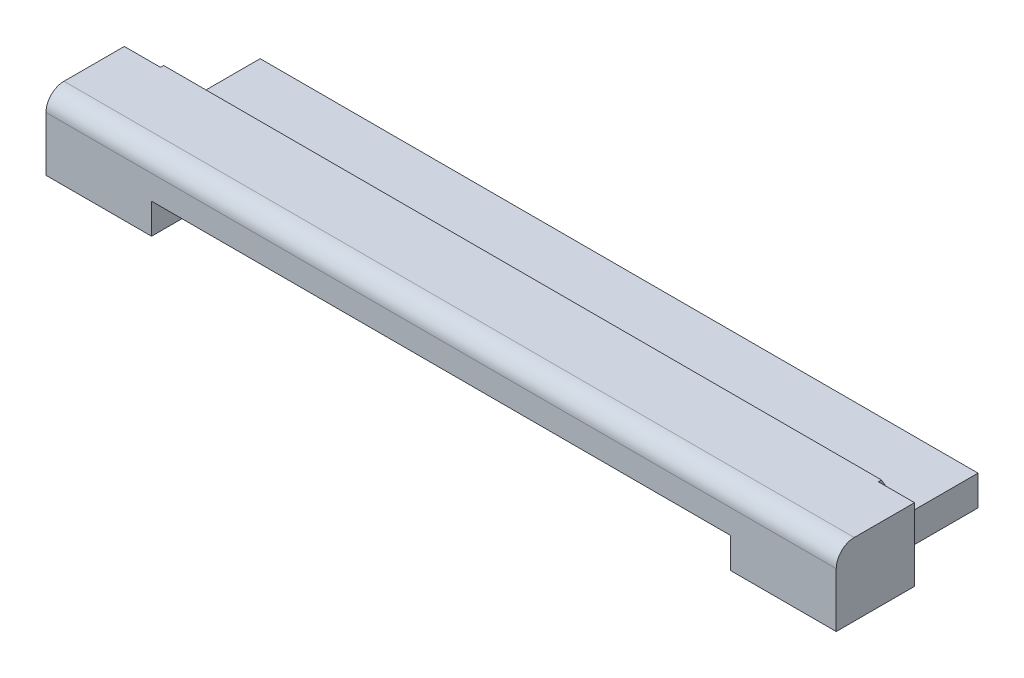
ISO-10303-21;
HEADER;
FILE_DESCRIPTION(('STEP AP214'),'2;1');
FILE_NAME('part.step','',(''),(''),'','','');
FILE_SCHEMA(('AUTOMOTIVE_DESIGN { 1 0 10303 214 1 1 1 1 }'));
ENDSEC;
DATA;
#1=APPLICATION_CONTEXT('core data for automotive mechanical design processes');
#2=APPLICATION_PROTOCOL_DEFINITION('international standard','automotive_design',2000,#1);
#3=PRODUCT_CONTEXT('',#1,'mechanical');
#4=PRODUCT('Part','Part','',(#3));
#5=PRODUCT_RELATED_PRODUCT_CATEGORY('part','',(#4));
#6=PRODUCT_DEFINITION_FORMATION('','',#4);
#7=PRODUCT_DEFINITION_CONTEXT('part definition',#1,'design');
#8=PRODUCT_DEFINITION('design','',#6,#7);
#9=PRODUCT_DEFINITION_SHAPE('','',#8);
#10=(LENGTH_UNIT() NAMED_UNIT(*) SI_UNIT(.MILLI.,.METRE.));
#11=(NAMED_UNIT(*) PLANE_ANGLE_UNIT() SI_UNIT($,.RADIAN.));
#12=(NAMED_UNIT(*) SI_UNIT($,.STERADIAN.) SOLID_ANGLE_UNIT());
#13=UNCERTAINTY_MEASURE_WITH_UNIT(LENGTH_MEASURE(1.E-05),#10,'distance_accuracy_value','');
#14=(GEOMETRIC_REPRESENTATION_CONTEXT(3) GLOBAL_UNCERTAINTY_ASSIGNED_CONTEXT((#13)) GLOBAL_UNIT_ASSIGNED_CONTEXT((#10,
#11,#12)) REPRESENTATION_CONTEXT('',''));
#15=CARTESIAN_POINT('',(0.,0.,0.));
#16=DIRECTION('',(0.,0.,1.));
#17=DIRECTION('',(1.,0.,0.));
#18=AXIS2_PLACEMENT_3D('',#15,#16,#17);
#19=CARTESIAN_POINT('',(-6.55,2.19730035691,0.999871293325));
#20=DIRECTION('',(0.,1.,0.));
#21=DIRECTION('',(0.,0.,1.));
#22=AXIS2_PLACEMENT_3D('',#19,#20,#21);
#23=PLANE('',#22);
#24=DIRECTION('',(1.,0.,0.));
#25=VECTOR('',#24,1.);
#26=CARTESIAN_POINT('',(-6.55,2.19730035691,-0.05241466703865));
#27=LINE('',#26,#25);
#28=CARTESIAN_POINT('',(-5.95,2.19730035691,-0.05241466703865));
#29=VERTEX_POINT('',#28);
#30=CARTESIAN_POINT('',(5.95,2.19730035691,-0.0524146670386499));
#31=VERTEX_POINT('',#30);
#32=EDGE_CURVE('E169',#29,#31,#27,.T.);
#33=ORIENTED_EDGE('',*,*,#32,.F.);
#34=DIRECTION('',(0.,0.,1.));
#35=VECTOR('',#34,1.);
#36=CARTESIAN_POINT('',(-5.95,2.19730035691,0.999871293325));
#37=LINE('',#36,#35);
#38=CARTESIAN_POINT('',(-5.95,2.19730035691,0.));
#39=VERTEX_POINT('',#38);
#40=EDGE_CURVE('E175',#29,#39,#37,.T.);
#41=ORIENTED_EDGE('',*,*,#40,.T.);
#42=DIRECTION('',(1.,0.,0.));
#43=VECTOR('',#42,1.);
#44=CARTESIAN_POINT('',(-6.55,2.19730035691,0.));
#45=LINE('',#44,#43);
#46=CARTESIAN_POINT('',(-6.55,2.19730035691,0.));
#47=VERTEX_POINT('',#46);
#48=EDGE_CURVE('E183',#39,#47,#45,.F.);
#49=ORIENTED_EDGE('',*,*,#48,.T.);
#50=DIRECTION('',(0.,0.,1.));
#51=VECTOR('',#50,1.);
#52=CARTESIAN_POINT('',(-6.55,2.19730035691,0.999871293325));
#53=LINE('',#52,#51);
#54=CARTESIAN_POINT('',(-6.55,2.19730035691015,0.999871293324999));
#55=VERTEX_POINT('',#54);
#56=EDGE_CURVE('E180',#47,#55,#53,.T.);
#57=ORIENTED_EDGE('',*,*,#56,.T.);
#58=DIRECTION('',(-1.,0.,0.));
#59=VECTOR('',#58,1.);
#60=CARTESIAN_POINT('',(-6.55,2.19730035691029,0.999871293324998));
#61=LINE('',#60,#59);
#62=CARTESIAN_POINT('',(6.55,2.19730035691015,0.999871293324999));
#63=VERTEX_POINT('',#62);
#64=EDGE_CURVE('E134',#63,#55,#61,.T.);
#65=ORIENTED_EDGE('',*,*,#64,.F.);
#66=DIRECTION('',(0.,0.,1.));
#67=VECTOR('',#66,1.);
#68=CARTESIAN_POINT('',(6.55,2.19730035691,0.999871293325));
#69=LINE('',#68,#67);
#70=CARTESIAN_POINT('',(6.55,2.19730035691,0.));
#71=VERTEX_POINT('',#70);
#72=EDGE_CURVE('E130',#63,#71,#69,.F.);
#73=ORIENTED_EDGE('',*,*,#72,.T.);
#74=DIRECTION('',(1.,0.,0.));
#75=VECTOR('',#74,1.);
#76=CARTESIAN_POINT('',(-6.55,2.19730035691,0.));
#77=LINE('',#76,#75);
#78=CARTESIAN_POINT('',(5.95,2.19730035691,0.));
#79=VERTEX_POINT('',#78);
#80=EDGE_CURVE('E179',#71,#79,#77,.F.);
#81=ORIENTED_EDGE('',*,*,#80,.T.);
#82=DIRECTION('',(0.,0.,1.));
#83=VECTOR('',#82,1.);
#84=CARTESIAN_POINT('',(5.95,2.19730035691,0.999871293325));
#85=LINE('',#84,#83);
#86=EDGE_CURVE('E177',#79,#31,#85,.F.);
#87=ORIENTED_EDGE('',*,*,#86,.T.);
#88=EDGE_LOOP('',(#33,#41,#49,#57,#65,#73,#81,#87));
#89=FACE_BOUND('',#88,.T.);
#90=ADVANCED_FACE('F17',(#89),#23,.T.);
#91=CARTESIAN_POINT('',(-6.55,2.19730035691,-0.05241466703865));
#92=DIRECTION('',(0.,0.490259924169971,-0.871576277070948));
#93=DIRECTION('',(0.,0.871576277070948,0.490259924169971));
#94=AXIS2_PLACEMENT_3D('',#91,#92,#93);
#95=PLANE('',#94);
#96=DIRECTION('',(0.,0.871576277070948,0.490259924169971));
#97=VECTOR('',#96,1.);
#98=CARTESIAN_POINT('',(5.95000000000001,2.19730035691,-0.0524146670386494));
#99=LINE('',#98,#97);
#100=CARTESIAN_POINT('',(5.95000000000001,1.49577843398594,-0.447019354871894));
#101=VERTEX_POINT('',#100);
#102=EDGE_CURVE('E135',#31,#101,#99,.F.);
#103=ORIENTED_EDGE('',*,*,#102,.T.);
#104=DIRECTION('',(1.,0.,0.));
#105=VECTOR('',#104,1.);
#106=CARTESIAN_POINT('',(-6.55,1.495778433986,-0.447019354872));
#107=LINE('',#106,#105);
#108=CARTESIAN_POINT('',(-5.95,1.49577911788319,-0.44701897018105));
#109=VERTEX_POINT('',#108);
#110=EDGE_CURVE('E156',#109,#101,#107,.T.);
#111=ORIENTED_EDGE('',*,*,#110,.F.);
#112=DIRECTION('',(0.,0.871576277070948,0.490259924169971));
#113=VECTOR('',#112,1.);
#114=CARTESIAN_POINT('',(-5.95,2.19730035691,-0.05241466703865));
#115=LINE('',#114,#113);
#116=EDGE_CURVE('E172',#109,#29,#115,.T.);
#117=ORIENTED_EDGE('',*,*,#116,.T.);
#118=ORIENTED_EDGE('',*,*,#32,.T.);
#119=EDGE_LOOP('',(#103,#111,#117,#118));
#120=FACE_BOUND('',#119,.T.);
#121=ADVANCED_FACE('F294',(#120),#95,.T.);
#122=CARTESIAN_POINT('',(-6.55,1.495778433986,-0.447019354872));
#123=DIRECTION('',(0.,0.999999999997422,2.27065273328796E-06));
#124=DIRECTION('',(0.,-2.27065273328796E-06,0.999999999997422));
#125=AXIS2_PLACEMENT_3D('',#122,#123,#124);
#126=PLANE('',#125);
#127=DIRECTION('',(0.,-2.27065273328796E-06,0.999999999997422));
#128=VECTOR('',#127,1.);
#129=CARTESIAN_POINT('',(5.95,1.495778433986,-0.447019354872));
#130=LINE('',#129,#128);
#131=CARTESIAN_POINT('',(5.95,1.49578048567773,-1.651778201092));
#132=VERTEX_POINT('',#131);
#133=EDGE_CURVE('E152',#101,#132,#130,.F.);
#134=ORIENTED_EDGE('',*,*,#133,.T.);
#135=DIRECTION('',(1.,0.,0.));
#136=VECTOR('',#135,1.);
#137=CARTESIAN_POINT('',(-6.55,1.495781169575,-1.651778201092));
#138=LINE('',#137,#136);
#139=CARTESIAN_POINT('',(-5.95,1.49578116957499,-1.651778768679));
#140=VERTEX_POINT('',#139);
#141=EDGE_CURVE('E284',#140,#132,#138,.T.);
#142=ORIENTED_EDGE('',*,*,#141,.F.);
#143=DIRECTION('',(0.,0.,-1.));
#144=VECTOR('',#143,1.);
#145=CARTESIAN_POINT('',(-5.95,1.495781169575,-0.1));
#146=LINE('',#145,#144);
#147=EDGE_CURVE('E151',#140,#109,#146,.F.);
#148=ORIENTED_EDGE('',*,*,#147,.T.);
#149=ORIENTED_EDGE('',*,*,#110,.T.);
#150=EDGE_LOOP('',(#134,#142,#148,#149));
#151=FACE_BOUND('',#150,.T.);
#152=ADVANCED_FACE('F291',(#151),#126,.T.);
#153=CARTESIAN_POINT('',(0.,1.5,2.6));
#154=DIRECTION('',(0.,-1.,0.));
#155=DIRECTION('',(0.,0.,-1.));
#156=AXIS2_PLACEMENT_3D('',#153,#154,#155);
#157=PLANE('',#156);
#158=DIRECTION('',(1.,0.,0.));
#159=VECTOR('',#158,1.);
#160=CARTESIAN_POINT('',(0.,1.5,0.1));
#161=LINE('',#160,#159);
#162=CARTESIAN_POINT('',(4.8,1.5,0.0999999999999999));
#163=VERTEX_POINT('',#162);
#164=CARTESIAN_POINT('',(-4.8,1.5,0.0999999999999999));
#165=VERTEX_POINT('',#164);
#166=EDGE_CURVE('E277',#163,#165,#161,.F.);
#167=ORIENTED_EDGE('',*,*,#166,.F.);
#168=DIRECTION('',(0.,0.,1.));
#169=VECTOR('',#168,1.);
#170=CARTESIAN_POINT('',(4.8,1.5,2.6));
#171=LINE('',#170,#169);
#172=CARTESIAN_POINT('',(4.8,1.5,1.29822152230308));
#173=VERTEX_POINT('',#172);
#174=EDGE_CURVE('E140',#173,#163,#171,.F.);
#175=ORIENTED_EDGE('',*,*,#174,.F.);
#176=DIRECTION('',(1.,0.,0.));
#177=VECTOR('',#176,1.);
#178=CARTESIAN_POINT('',(-6.55,1.5,1.29822180849531));
#179=LINE('',#178,#177);
#180=CARTESIAN_POINT('',(-4.8,1.5,1.29822180849508));
#181=VERTEX_POINT('',#180);
#182=EDGE_CURVE('E266',#181,#173,#179,.T.);
#183=ORIENTED_EDGE('',*,*,#182,.F.);
#184=DIRECTION('',(0.,0.,-1.));
#185=VECTOR('',#184,1.);
#186=CARTESIAN_POINT('',(-4.8,1.5,2.6));
#187=LINE('',#186,#185);
#188=EDGE_CURVE('E272',#165,#181,#187,.F.);
#189=ORIENTED_EDGE('',*,*,#188,.F.);
#190=EDGE_LOOP('',(#167,#175,#183,#189));
#191=FACE_BOUND('',#190,.T.);
#192=ADVANCED_FACE('F293',(#191),#157,.T.);
#193=CARTESIAN_POINT('',(-6.55,1.900051660455,1.000974002793));
#194=DIRECTION('',(-1.,0.,0.));
#195=DIRECTION('',(0.,0.,1.));
#196=AXIS2_PLACEMENT_3D('',#193,#194,#195);
#197=CYLINDRICAL_SURFACE('',#196,0.29725074182);
#198=DIRECTION('',(1.,0.,0.));
#199=VECTOR('',#198,1.);
#200=CARTESIAN_POINT('',(-6.55,1.898953037161,1.29822271437914));
#201=LINE('',#200,#199);
#202=CARTESIAN_POINT('',(6.55,1.898953037161,1.29822322193754));
#203=VERTEX_POINT('',#202);
#204=CARTESIAN_POINT('',(-6.55,1.898953037161,1.29822271437895));
#205=VERTEX_POINT('',#204);
#206=EDGE_CURVE('E138',#203,#205,#201,.F.);
#207=ORIENTED_EDGE('',*,*,#206,.F.);
#208=DIRECTION('',(0.,1.,0.));
#209=VECTOR('',#208,1.);
#210=CARTESIAN_POINT('',(6.55,1.451827815541,1.298224744613));
#211=LINE('',#210,#209);
#212=CARTESIAN_POINT('',(6.55,1.900051660455,1.298224744613));
#213=VERTEX_POINT('',#212);
#214=EDGE_CURVE('E126',#213,#203,#211,.F.);
#215=ORIENTED_EDGE('',*,*,#214,.F.);
#216=CARTESIAN_POINT('',(6.55,1.900051660455,1.000974002793));
#217=DIRECTION('',(-1.,0.,0.));
#218=DIRECTION('',(0.,0.,1.));
#219=AXIS2_PLACEMENT_3D('',#216,#217,#218);
#220=CIRCLE('',#219,0.29725074182);
#221=EDGE_CURVE('E20',#213,#63,#220,.T.);
#222=ORIENTED_EDGE('',*,*,#221,.T.);
#223=ORIENTED_EDGE('',*,*,#64,.T.);
#224=CARTESIAN_POINT('',(-6.55,1.900051660455,1.000974002793));
#225=DIRECTION('',(-1.,0.,0.));
#226=DIRECTION('',(0.,0.,1.));
#227=AXIS2_PLACEMENT_3D('',#224,#225,#226);
#228=CIRCLE('',#227,0.29725074182);
#229=EDGE_CURVE('E150',#55,#205,#228,.F.);
#230=ORIENTED_EDGE('',*,*,#229,.T.);
#231=EDGE_LOOP('',(#207,#215,#222,#223,#230));
#232=FACE_BOUND('',#231,.T.);
#233=ADVANCED_FACE('F136',(#232),#197,.T.);
#234=CARTESIAN_POINT('',(-5.95,1.1,-0.1));
#235=DIRECTION('',(1.,0.,0.));
#236=DIRECTION('',(0.,0.,-1.));
#237=AXIS2_PLACEMENT_3D('',#234,#235,#236);
#238=PLANE('',#237);
#239=DIRECTION('',(0.,1.,0.));
#240=VECTOR('',#239,1.);
#241=CARTESIAN_POINT('',(-5.95,1.124019607843,0.));
#242=LINE('',#241,#240);
#243=CARTESIAN_POINT('',(-5.95,0.995844709805935,0.));
#244=VERTEX_POINT('',#243);
#245=EDGE_CURVE('E197',#244,#39,#242,.T.);
#246=ORIENTED_EDGE('',*,*,#245,.T.);
#247=ORIENTED_EDGE('',*,*,#40,.F.);
#248=ORIENTED_EDGE('',*,*,#116,.F.);
#249=ORIENTED_EDGE('',*,*,#147,.F.);
#250=DIRECTION('',(0.,0.999999999997422,2.27065273324096E-06));
#251=VECTOR('',#250,1.);
#252=CARTESIAN_POINT('',(-5.95,1.495781169575,-1.651778201092));
#253=LINE('',#252,#251);
#254=CARTESIAN_POINT('',(-5.95,0.9958465851145,-1.65177933626589));
#255=VERTEX_POINT('',#254);
#256=EDGE_CURVE('E154',#255,#140,#253,.T.);
#257=ORIENTED_EDGE('',*,*,#256,.F.);
#258=DIRECTION('',(0.,2.27065272919496E-06,-0.999999999997422));
#259=VECTOR('',#258,1.);
#260=CARTESIAN_POINT('',(-5.95,0.995848460423,-1.651779336266));
#261=LINE('',#260,#259);
#262=EDGE_CURVE('E196',#244,#255,#261,.T.);
#263=ORIENTED_EDGE('',*,*,#262,.F.);
#264=EDGE_LOOP('',(#246,#247,#248,#249,#257,#263));
#265=FACE_BOUND('',#264,.T.);
#266=ADVANCED_FACE('F212',(#265),#238,.F.);
#267=CARTESIAN_POINT('',(-6.55,1.495781169575,-1.651778201092));
#268=DIRECTION('',(0.,2.27065273324096E-06,-0.999999999997422));
#269=DIRECTION('',(0.,0.999999999997422,2.27065273324096E-06));
#270=AXIS2_PLACEMENT_3D('',#267,#268,#269);
#271=PLANE('',#270);
#272=DIRECTION('',(0.,1.,0.));
#273=VECTOR('',#272,1.);
#274=CARTESIAN_POINT('',(5.95,1.1,-1.651778201092));
#275=LINE('',#274,#273);
#276=CARTESIAN_POINT('',(5.95,0.995848460423,-1.65177905247229));
#277=VERTEX_POINT('',#276);
#278=EDGE_CURVE('E282',#132,#277,#275,.F.);
#279=ORIENTED_EDGE('',*,*,#278,.T.);
#280=DIRECTION('',(1.,0.,0.));
#281=VECTOR('',#280,1.);
#282=CARTESIAN_POINT('',(-6.55,0.995848460423,-1.651779336266));
#283=LINE('',#282,#281);
#284=EDGE_CURVE('E255',#255,#277,#283,.T.);
#285=ORIENTED_EDGE('',*,*,#284,.F.);
#286=ORIENTED_EDGE('',*,*,#256,.T.);
#287=ORIENTED_EDGE('',*,*,#141,.T.);
#288=EDGE_LOOP('',(#279,#285,#286,#287));
#289=FACE_BOUND('',#288,.T.);
#290=ADVANCED_FACE('F289',(#289),#271,.T.);
#291=CARTESIAN_POINT('',(5.95,1.1,-0.1));
#292=DIRECTION('',(-1.,0.,0.));
#293=DIRECTION('',(0.,0.,1.));
#294=AXIS2_PLACEMENT_3D('',#291,#292,#293);
#295=PLANE('',#294);
#296=ORIENTED_EDGE('',*,*,#278,.F.);
#297=ORIENTED_EDGE('',*,*,#133,.F.);
#298=ORIENTED_EDGE('',*,*,#102,.F.);
#299=ORIENTED_EDGE('',*,*,#86,.F.);
#300=DIRECTION('',(0.,1.,0.));
#301=VECTOR('',#300,1.);
#302=CARTESIAN_POINT('',(5.95,1.124019607843,0.));
#303=LINE('',#302,#301);
#304=CARTESIAN_POINT('',(5.95,0.995846585114435,0.));
#305=VERTEX_POINT('',#304);
#306=EDGE_CURVE('E145',#79,#305,#303,.F.);
#307=ORIENTED_EDGE('',*,*,#306,.T.);
#308=DIRECTION('',(0.,2.27065272919496E-06,-0.999999999997422));
#309=VECTOR('',#308,1.);
#310=CARTESIAN_POINT('',(5.95,0.995848460423,-1.651779336266));
#311=LINE('',#310,#309);
#312=EDGE_CURVE('E251',#277,#305,#311,.F.);
#313=ORIENTED_EDGE('',*,*,#312,.F.);
#314=EDGE_LOOP('',(#296,#297,#298,#299,#307,#313));
#315=FACE_BOUND('',#314,.T.);
#316=ADVANCED_FACE('F335',(#315),#295,.F.);
#317=CARTESIAN_POINT('',(0.,1.124019607843,0.));
#318=DIRECTION('',(0.,0.,1.));
#319=DIRECTION('',(1.,0.,0.));
#320=AXIS2_PLACEMENT_3D('',#317,#318,#319);
#321=PLANE('',#320);
#322=ORIENTED_EDGE('',*,*,#306,.F.);
#323=ORIENTED_EDGE('',*,*,#80,.F.);
#324=DIRECTION('',(0.,1.,0.));
#325=VECTOR('',#324,1.);
#326=CARTESIAN_POINT('',(6.55,1.451827815541,0.));
#327=LINE('',#326,#325);
#328=CARTESIAN_POINT('',(6.55,0.995843972853936,0.));
#329=VERTEX_POINT('',#328);
#330=EDGE_CURVE('E141',#329,#71,#327,.T.);
#331=ORIENTED_EDGE('',*,*,#330,.F.);
#332=DIRECTION('',(1.,0.,0.));
#333=VECTOR('',#332,1.);
#334=CARTESIAN_POINT('',(-6.55,0.995844709805742,0.));
#335=LINE('',#334,#333);
#336=EDGE_CURVE('E248',#305,#329,#335,.T.);
#337=ORIENTED_EDGE('',*,*,#336,.F.);
#338=EDGE_LOOP('',(#322,#323,#331,#337));
#339=FACE_BOUND('',#338,.T.);
#340=ADVANCED_FACE('F332',(#339),#321,.F.);
#341=CARTESIAN_POINT('',(6.55,1.451827815541,-0.07423294469808));
#342=DIRECTION('',(1.,0.,0.));
#343=DIRECTION('',(0.,0.,-1.));
#344=AXIS2_PLACEMENT_3D('',#341,#342,#343);
#345=PLANE('',#344);
#346=DIRECTION('',(0.,-0.999999999997422,-2.27065279629096E-06));
#347=VECTOR('',#346,1.);
#348=CARTESIAN_POINT('',(6.55,0.995841761998,1.298220663727));
#349=LINE('',#348,#347);
#350=CARTESIAN_POINT('',(6.55,0.99584176200019,1.298220663727));
#351=VERTEX_POINT('',#350);
#352=EDGE_CURVE('E236',#351,#203,#349,.F.);
#353=ORIENTED_EDGE('',*,*,#352,.F.);
#354=DIRECTION('',(0.,2.27065272919496E-06,-0.999999999997422));
#355=VECTOR('',#354,1.);
#356=CARTESIAN_POINT('',(6.55,0.995848460423,-1.651779336266));
#357=LINE('',#356,#355);
#358=EDGE_CURVE('E245',#329,#351,#357,.F.);
#359=ORIENTED_EDGE('',*,*,#358,.F.);
#360=ORIENTED_EDGE('',*,*,#330,.T.);
#361=ORIENTED_EDGE('',*,*,#72,.F.);
#362=ORIENTED_EDGE('',*,*,#221,.F.);
#363=ORIENTED_EDGE('',*,*,#214,.T.);
#364=EDGE_LOOP('',(#353,#359,#360,#361,#362,#363));
#365=FACE_BOUND('',#364,.T.);
#366=ADVANCED_FACE('F125',(#365),#345,.T.);
#367=CARTESIAN_POINT('',(4.8,0.75,2.6));
#368=DIRECTION('',(-1.,0.,0.));
#369=DIRECTION('',(0.,0.,1.));
#370=AXIS2_PLACEMENT_3D('',#367,#368,#369);
#371=PLANE('',#370);
#372=DIRECTION('',(0.,1.,0.));
#373=VECTOR('',#372,1.);
#374=CARTESIAN_POINT('',(4.8,0.75,0.1));
#375=LINE('',#374,#373);
#376=CARTESIAN_POINT('',(4.8,0.995844482740867,0.0999999999999999));
#377=VERTEX_POINT('',#376);
#378=EDGE_CURVE('E143',#377,#163,#375,.T.);
#379=ORIENTED_EDGE('',*,*,#378,.F.);
#380=DIRECTION('',(0.,2.27065272919496E-06,-0.999999999997422));
#381=VECTOR('',#380,1.);
#382=CARTESIAN_POINT('',(4.8,0.995848460423,-1.651779336266));
#383=LINE('',#382,#381);
#384=CARTESIAN_POINT('',(4.8,0.995842442183612,1.298220663727));
#385=VERTEX_POINT('',#384);
#386=EDGE_CURVE('E244',#385,#377,#383,.T.);
#387=ORIENTED_EDGE('',*,*,#386,.F.);
#388=DIRECTION('',(0.,-0.999999999997422,-2.27065279629096E-06));
#389=VECTOR('',#388,1.);
#390=CARTESIAN_POINT('',(4.8,0.995841761998,1.298220663727));
#391=LINE('',#390,#389);
#392=EDGE_CURVE('E238',#173,#385,#391,.T.);
#393=ORIENTED_EDGE('',*,*,#392,.F.);
#394=ORIENTED_EDGE('',*,*,#174,.T.);
#395=EDGE_LOOP('',(#379,#387,#393,#394));
#396=FACE_BOUND('',#395,.T.);
#397=ADVANCED_FACE('F325',(#396),#371,.T.);
#398=CARTESIAN_POINT('',(0.,0.75,0.1));
#399=DIRECTION('',(0.,0.,1.));
#400=DIRECTION('',(1.,0.,0.));
#401=AXIS2_PLACEMENT_3D('',#398,#399,#400);
#402=PLANE('',#401);
#403=ORIENTED_EDGE('',*,*,#166,.T.);
#404=DIRECTION('',(0.,1.,0.));
#405=VECTOR('',#404,1.);
#406=CARTESIAN_POINT('',(-4.8,0.75,0.0999999999999998));
#407=LINE('',#406,#405);
#408=CARTESIAN_POINT('',(-4.8,0.995843802555117,0.1));
#409=VERTEX_POINT('',#408);
#410=EDGE_CURVE('E274',#409,#165,#407,.T.);
#411=ORIENTED_EDGE('',*,*,#410,.F.);
#412=DIRECTION('',(1.,0.,0.));
#413=VECTOR('',#412,1.);
#414=CARTESIAN_POINT('',(-6.55,0.995844482740469,0.1));
#415=LINE('',#414,#413);
#416=EDGE_CURVE('E496',#377,#409,#415,.F.);
#417=ORIENTED_EDGE('',*,*,#416,.F.);
#418=ORIENTED_EDGE('',*,*,#378,.T.);
#419=EDGE_LOOP('',(#403,#411,#417,#418));
#420=FACE_BOUND('',#419,.T.);
#421=ADVANCED_FACE('F321',(#420),#402,.T.);
#422=CARTESIAN_POINT('',(-4.8,0.75,2.6));
#423=DIRECTION('',(1.,0.,0.));
#424=DIRECTION('',(0.,0.,-1.));
#425=AXIS2_PLACEMENT_3D('',#422,#423,#424);
#426=PLANE('',#425);
#427=ORIENTED_EDGE('',*,*,#410,.T.);
#428=ORIENTED_EDGE('',*,*,#188,.T.);
#429=DIRECTION('',(0.,-0.999999999997422,-2.27065279629096E-06));
#430=VECTOR('',#429,1.);
#431=CARTESIAN_POINT('',(-4.8,0.995841761998,1.298220663727));
#432=LINE('',#431,#430);
#433=CARTESIAN_POINT('',(-4.8,0.995841761997862,1.298221236111));
#434=VERTEX_POINT('',#433);
#435=EDGE_CURVE('E269',#434,#181,#432,.F.);
#436=ORIENTED_EDGE('',*,*,#435,.F.);
#437=DIRECTION('',(0.,2.27065272919496E-06,-0.999999999997422));
#438=VECTOR('',#437,1.);
#439=CARTESIAN_POINT('',(-4.8,0.995848460423,-1.651779336266));
#440=LINE('',#439,#438);
#441=EDGE_CURVE('E228',#409,#434,#440,.F.);
#442=ORIENTED_EDGE('',*,*,#441,.F.);
#443=EDGE_LOOP('',(#427,#428,#436,#442));
#444=FACE_BOUND('',#443,.T.);
#445=ADVANCED_FACE('F317',(#444),#426,.T.);
#446=CARTESIAN_POINT('',(-6.55,0.995841761998,1.298220663727));
#447=DIRECTION('',(0.,-2.27065279629096E-06,0.999999999997422));
#448=DIRECTION('',(0.,-0.999999999997422,-2.27065279629096E-06));
#449=AXIS2_PLACEMENT_3D('',#446,#447,#448);
#450=PLANE('',#449);
#451=DIRECTION('',(0.,1.,0.));
#452=VECTOR('',#451,1.);
#453=CARTESIAN_POINT('',(-6.55,1.451827815541,1.298222714379));
#454=LINE('',#453,#452);
#455=CARTESIAN_POINT('',(-6.55,0.995841761998,1.298222714379));
#456=VERTEX_POINT('',#455);
#457=EDGE_CURVE('E206',#205,#456,#454,.F.);
#458=ORIENTED_EDGE('',*,*,#457,.T.);
#459=DIRECTION('',(1.,0.,0.));
#460=VECTOR('',#459,1.);
#461=CARTESIAN_POINT('',(-6.55,0.995841761997449,1.298220663727));
#462=LINE('',#461,#460);
#463=EDGE_CURVE('E225',#434,#456,#462,.F.);
#464=ORIENTED_EDGE('',*,*,#463,.F.);
#465=ORIENTED_EDGE('',*,*,#435,.T.);
#466=ORIENTED_EDGE('',*,*,#182,.T.);
#467=ORIENTED_EDGE('',*,*,#392,.T.);
#468=DIRECTION('',(1.,0.,0.));
#469=VECTOR('',#468,1.);
#470=CARTESIAN_POINT('',(-6.55,0.995841761997449,1.298220663727));
#471=LINE('',#470,#469);
#472=EDGE_CURVE('E241',#351,#385,#471,.F.);
#473=ORIENTED_EDGE('',*,*,#472,.F.);
#474=ORIENTED_EDGE('',*,*,#352,.T.);
#475=ORIENTED_EDGE('',*,*,#206,.T.);
#476=EDGE_LOOP('',(#458,#464,#465,#466,#467,#473,#474,#475));
#477=FACE_BOUND('',#476,.T.);
#478=ADVANCED_FACE('F314',(#477),#450,.T.);
#479=CARTESIAN_POINT('',(-6.55,1.451827815541,-0.07423294469808));
#480=DIRECTION('',(1.,0.,0.));
#481=DIRECTION('',(0.,0.,-1.));
#482=AXIS2_PLACEMENT_3D('',#479,#480,#481);
#483=PLANE('',#482);
#484=DIRECTION('',(0.,2.27065272919496E-06,-0.999999999997422));
#485=VECTOR('',#484,1.);
#486=CARTESIAN_POINT('',(-6.55,0.995848460423,-1.651779336266));
#487=LINE('',#486,#485);
#488=CARTESIAN_POINT('',(-6.55,0.995843235901935,0.));
#489=VERTEX_POINT('',#488);
#490=EDGE_CURVE('E26',#456,#489,#487,.T.);
#491=ORIENTED_EDGE('',*,*,#490,.F.);
#492=ORIENTED_EDGE('',*,*,#457,.F.);
#493=ORIENTED_EDGE('',*,*,#229,.F.);
#494=ORIENTED_EDGE('',*,*,#56,.F.);
#495=DIRECTION('',(0.,1.,0.));
#496=VECTOR('',#495,1.);
#497=CARTESIAN_POINT('',(-6.55,1.124019607843,0.));
#498=LINE('',#497,#496);
#499=EDGE_CURVE('E35',#47,#489,#498,.F.);
#500=ORIENTED_EDGE('',*,*,#499,.T.);
#501=EDGE_LOOP('',(#491,#492,#493,#494,#500));
#502=FACE_BOUND('',#501,.T.);
#503=ADVANCED_FACE('F309',(#502),#483,.F.);
#504=CARTESIAN_POINT('',(0.,1.124019607843,0.));
#505=DIRECTION('',(0.,0.,1.));
#506=DIRECTION('',(1.,0.,0.));
#507=AXIS2_PLACEMENT_3D('',#504,#505,#506);
#508=PLANE('',#507);
#509=ORIENTED_EDGE('',*,*,#499,.F.);
#510=ORIENTED_EDGE('',*,*,#48,.F.);
#511=ORIENTED_EDGE('',*,*,#245,.F.);
#512=DIRECTION('',(1.,0.,0.));
#513=VECTOR('',#512,1.);
#514=CARTESIAN_POINT('',(-6.55,0.995844709805742,0.));
#515=LINE('',#514,#513);
#516=EDGE_CURVE('E11',#489,#244,#515,.T.);
#517=ORIENTED_EDGE('',*,*,#516,.F.);
#518=EDGE_LOOP('',(#509,#510,#511,#517));
#519=FACE_BOUND('',#518,.T.);
#520=ADVANCED_FACE('F217',(#519),#508,.F.);
#521=CARTESIAN_POINT('',(-6.55,0.995848460423,-1.651779336266));
#522=DIRECTION('',(0.,-0.999999999997422,-2.27065272919496E-06));
#523=DIRECTION('',(0.,2.27065272919496E-06,-0.999999999997422));
#524=AXIS2_PLACEMENT_3D('',#521,#522,#523);
#525=PLANE('',#524);
#526=ORIENTED_EDGE('',*,*,#490,.T.);
#527=ORIENTED_EDGE('',*,*,#516,.T.);
#528=ORIENTED_EDGE('',*,*,#262,.T.);
#529=ORIENTED_EDGE('',*,*,#284,.T.);
#530=ORIENTED_EDGE('',*,*,#312,.T.);
#531=ORIENTED_EDGE('',*,*,#336,.T.);
#532=ORIENTED_EDGE('',*,*,#358,.T.);
#533=ORIENTED_EDGE('',*,*,#472,.T.);
#534=ORIENTED_EDGE('',*,*,#386,.T.);
#535=ORIENTED_EDGE('',*,*,#416,.T.);
#536=ORIENTED_EDGE('',*,*,#441,.T.);
#537=ORIENTED_EDGE('',*,*,#463,.T.);
#538=EDGE_LOOP('',(#526,#527,#528,#529,#530,#531,#532,#533,#534,#535,#536,#537));
#539=FACE_BOUND('',#538,.T.);
#540=ADVANCED_FACE('F220',(#539),#525,.T.);
#541=CLOSED_SHELL('',(#90,#121,#152,#192,#233,#266,#290,#316,#340,#366,#397,#421,#445,#478,#503,
#520,#540));
#542=MANIFOLD_SOLID_BREP('B1',#541);
#543=ADVANCED_BREP_SHAPE_REPRESENTATION('',(#18,#542),#14);
#544=SHAPE_DEFINITION_REPRESENTATION(#9,#543);
ENDSEC;
END-ISO-10303-21;
